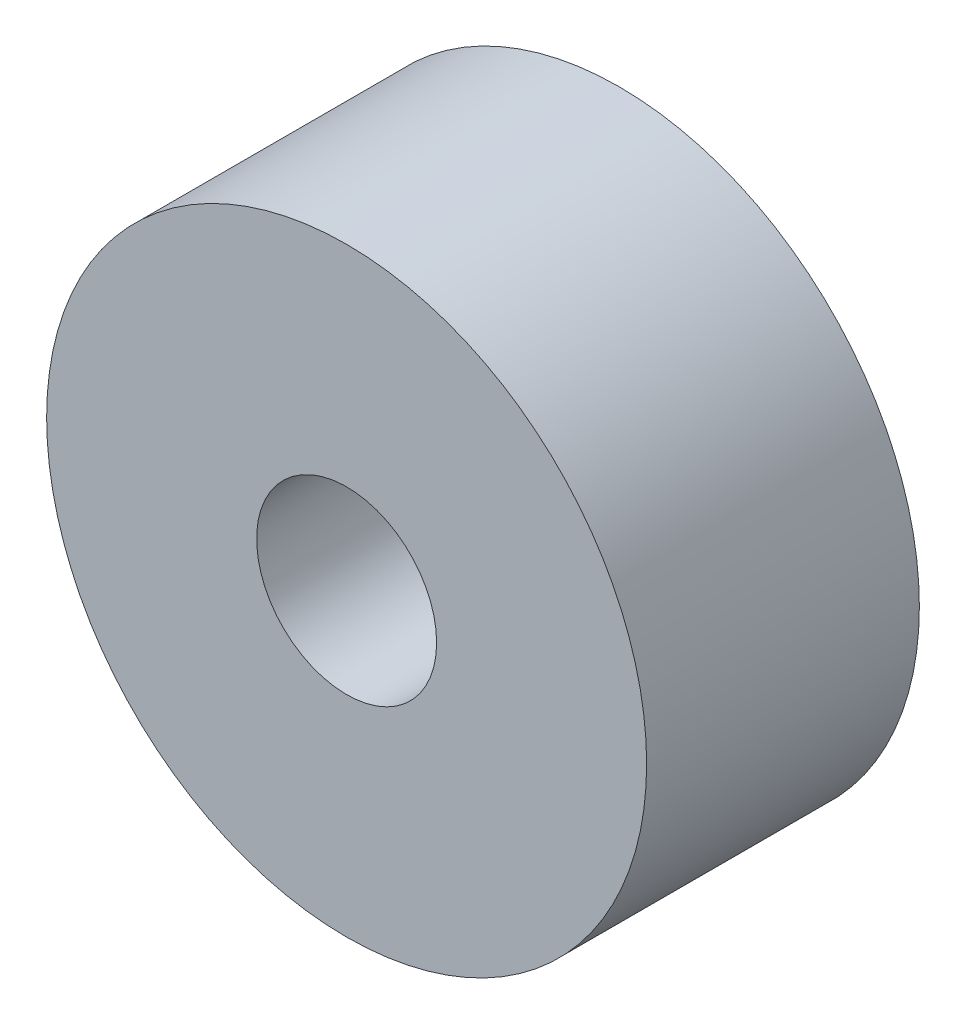
ISO-10303-21;
HEADER;
FILE_DESCRIPTION(('STEP AP214'),'2;1');
FILE_NAME('part.step','',(''),(''),'','','');
FILE_SCHEMA(('AUTOMOTIVE_DESIGN { 1 0 10303 214 1 1 1 1 }'));
ENDSEC;
DATA;
#1=APPLICATION_CONTEXT('core data for automotive mechanical design processes');
#2=APPLICATION_PROTOCOL_DEFINITION('international standard','automotive_design',2000,#1);
#3=PRODUCT_CONTEXT('',#1,'mechanical');
#4=PRODUCT('Part','Part','',(#3));
#5=PRODUCT_RELATED_PRODUCT_CATEGORY('part','',(#4));
#6=PRODUCT_DEFINITION_FORMATION('','',#4);
#7=PRODUCT_DEFINITION_CONTEXT('part definition',#1,'design');
#8=PRODUCT_DEFINITION('design','',#6,#7);
#9=PRODUCT_DEFINITION_SHAPE('','',#8);
#10=(LENGTH_UNIT() NAMED_UNIT(*) SI_UNIT(.MILLI.,.METRE.));
#11=(NAMED_UNIT(*) PLANE_ANGLE_UNIT() SI_UNIT($,.RADIAN.));
#12=(NAMED_UNIT(*) SI_UNIT($,.STERADIAN.) SOLID_ANGLE_UNIT());
#13=UNCERTAINTY_MEASURE_WITH_UNIT(LENGTH_MEASURE(1.E-05),#10,'distance_accuracy_value','');
#14=(GEOMETRIC_REPRESENTATION_CONTEXT(3) GLOBAL_UNCERTAINTY_ASSIGNED_CONTEXT((#13)) GLOBAL_UNIT_ASSIGNED_CONTEXT((#10,
#11,#12)) REPRESENTATION_CONTEXT('',''));
#15=CARTESIAN_POINT('',(0.,0.,0.));
#16=DIRECTION('',(0.,0.,1.));
#17=DIRECTION('',(1.,0.,0.));
#18=AXIS2_PLACEMENT_3D('',#15,#16,#17);
#19=CARTESIAN_POINT('',(0.,0.,2.5));
#20=DIRECTION('',(0.,0.,1.));
#21=DIRECTION('',(1.,0.,0.));
#22=AXIS2_PLACEMENT_3D('',#19,#20,#21);
#23=CYLINDRICAL_SURFACE('',#22,2.5);
#24=CARTESIAN_POINT('',(0.,0.,0.));
#25=DIRECTION('',(0.,0.,1.));
#26=DIRECTION('',(1.,0.,0.));
#27=AXIS2_PLACEMENT_3D('',#24,#25,#26);
#28=CIRCLE('',#27,2.5);
#29=CARTESIAN_POINT('',(2.5,0.,0.));
#30=VERTEX_POINT('',#29);
#31=EDGE_CURVE('E62',#30,#30,#28,.T.);
#32=ORIENTED_EDGE('',*,*,#31,.T.);
#33=EDGE_LOOP('',(#32));
#34=FACE_BOUND('',#33,.T.);
#35=CARTESIAN_POINT('',(0.,0.,-2.5));
#36=DIRECTION('',(0.,0.,1.));
#37=DIRECTION('',(1.,0.,0.));
#38=AXIS2_PLACEMENT_3D('',#35,#36,#37);
#39=CIRCLE('',#38,2.5);
#40=CARTESIAN_POINT('',(2.5,0.,-2.5));
#41=VERTEX_POINT('',#40);
#42=EDGE_CURVE('E10',#41,#41,#39,.T.);
#43=ORIENTED_EDGE('',*,*,#42,.F.);
#44=EDGE_LOOP('',(#43));
#45=FACE_BOUND('',#44,.T.);
#46=ADVANCED_FACE('F40',(#34,#45),#23,.F.);
#47=CARTESIAN_POINT('',(2.5,0.,-2.5));
#48=DIRECTION('',(0.,0.,-1.));
#49=DIRECTION('',(-1.,0.,0.));
#50=AXIS2_PLACEMENT_3D('',#47,#48,#49);
#51=PLANE('',#50);
#52=ORIENTED_EDGE('',*,*,#42,.T.);
#53=EDGE_LOOP('',(#52));
#54=FACE_BOUND('',#53,.T.);
#55=CARTESIAN_POINT('',(0.,0.,-2.5));
#56=DIRECTION('',(0.,0.,1.));
#57=DIRECTION('',(1.,0.,0.));
#58=AXIS2_PLACEMENT_3D('',#55,#56,#57);
#59=CIRCLE('',#58,5.5);
#60=CARTESIAN_POINT('',(5.5,0.,-2.5));
#61=VERTEX_POINT('',#60);
#62=EDGE_CURVE('E46',#61,#61,#59,.T.);
#63=ORIENTED_EDGE('',*,*,#62,.F.);
#64=EDGE_LOOP('',(#63));
#65=FACE_BOUND('',#64,.T.);
#66=ADVANCED_FACE('F80',(#54,#65),#51,.T.);
#67=CARTESIAN_POINT('',(0.,0.,2.5));
#68=DIRECTION('',(0.,0.,1.));
#69=DIRECTION('',(1.,0.,0.));
#70=AXIS2_PLACEMENT_3D('',#67,#68,#69);
#71=CYLINDRICAL_SURFACE('',#70,5.5);
#72=ORIENTED_EDGE('',*,*,#62,.T.);
#73=EDGE_LOOP('',(#72));
#74=FACE_BOUND('',#73,.T.);
#75=CARTESIAN_POINT('',(0.,0.,2.5));
#76=DIRECTION('',(0.,0.,1.));
#77=DIRECTION('',(1.,0.,0.));
#78=AXIS2_PLACEMENT_3D('',#75,#76,#77);
#79=CIRCLE('',#78,5.5);
#80=CARTESIAN_POINT('',(5.5,0.,2.5));
#81=VERTEX_POINT('',#80);
#82=EDGE_CURVE('E50',#81,#81,#79,.T.);
#83=ORIENTED_EDGE('',*,*,#82,.F.);
#84=EDGE_LOOP('',(#83));
#85=FACE_BOUND('',#84,.T.);
#86=ADVANCED_FACE('F84',(#74,#85),#71,.T.);
#87=CARTESIAN_POINT('',(5.5,0.,2.5));
#88=DIRECTION('',(0.,0.,1.));
#89=DIRECTION('',(1.,0.,0.));
#90=AXIS2_PLACEMENT_3D('',#87,#88,#89);
#91=PLANE('',#90);
#92=ORIENTED_EDGE('',*,*,#82,.T.);
#93=EDGE_LOOP('',(#92));
#94=FACE_BOUND('',#93,.T.);
#95=CARTESIAN_POINT('',(0.,0.,2.5));
#96=DIRECTION('',(0.,0.,1.));
#97=DIRECTION('',(1.,0.,0.));
#98=AXIS2_PLACEMENT_3D('',#95,#96,#97);
#99=CIRCLE('',#98,1.65);
#100=CARTESIAN_POINT('',(1.65,0.,2.5));
#101=VERTEX_POINT('',#100);
#102=EDGE_CURVE('E54',#101,#101,#99,.T.);
#103=ORIENTED_EDGE('',*,*,#102,.F.);
#104=EDGE_LOOP('',(#103));
#105=FACE_BOUND('',#104,.T.);
#106=ADVANCED_FACE('F76',(#94,#105),#91,.T.);
#107=CARTESIAN_POINT('',(0.,0.,2.5));
#108=DIRECTION('',(0.,0.,1.));
#109=DIRECTION('',(1.,0.,0.));
#110=AXIS2_PLACEMENT_3D('',#107,#108,#109);
#111=CYLINDRICAL_SURFACE('',#110,1.65);
#112=ORIENTED_EDGE('',*,*,#102,.T.);
#113=EDGE_LOOP('',(#112));
#114=FACE_BOUND('',#113,.T.);
#115=CARTESIAN_POINT('',(0.,0.,0.));
#116=DIRECTION('',(0.,0.,1.));
#117=DIRECTION('',(1.,0.,0.));
#118=AXIS2_PLACEMENT_3D('',#115,#116,#117);
#119=CIRCLE('',#118,1.65);
#120=CARTESIAN_POINT('',(1.65,0.,0.));
#121=VERTEX_POINT('',#120);
#122=EDGE_CURVE('E59',#121,#121,#119,.T.);
#123=ORIENTED_EDGE('',*,*,#122,.F.);
#124=EDGE_LOOP('',(#123));
#125=FACE_BOUND('',#124,.T.);
#126=ADVANCED_FACE('F70',(#114,#125),#111,.F.);
#127=CARTESIAN_POINT('',(1.65,0.,0.));
#128=DIRECTION('',(0.,0.,-1.));
#129=DIRECTION('',(-1.,0.,0.));
#130=AXIS2_PLACEMENT_3D('',#127,#128,#129);
#131=PLANE('',#130);
#132=ORIENTED_EDGE('',*,*,#122,.T.);
#133=EDGE_LOOP('',(#132));
#134=FACE_BOUND('',#133,.T.);
#135=ORIENTED_EDGE('',*,*,#31,.F.);
#136=EDGE_LOOP('',(#135));
#137=FACE_BOUND('',#136,.T.);
#138=ADVANCED_FACE('F68',(#134,#137),#131,.T.);
#139=CLOSED_SHELL('',(#46,#66,#86,#106,#126,#138));
#140=MANIFOLD_SOLID_BREP('B2',#139);
#141=ADVANCED_BREP_SHAPE_REPRESENTATION('',(#18,#140),#14);
#142=SHAPE_DEFINITION_REPRESENTATION(#9,#141);
ENDSEC;
END-ISO-10303-21;
